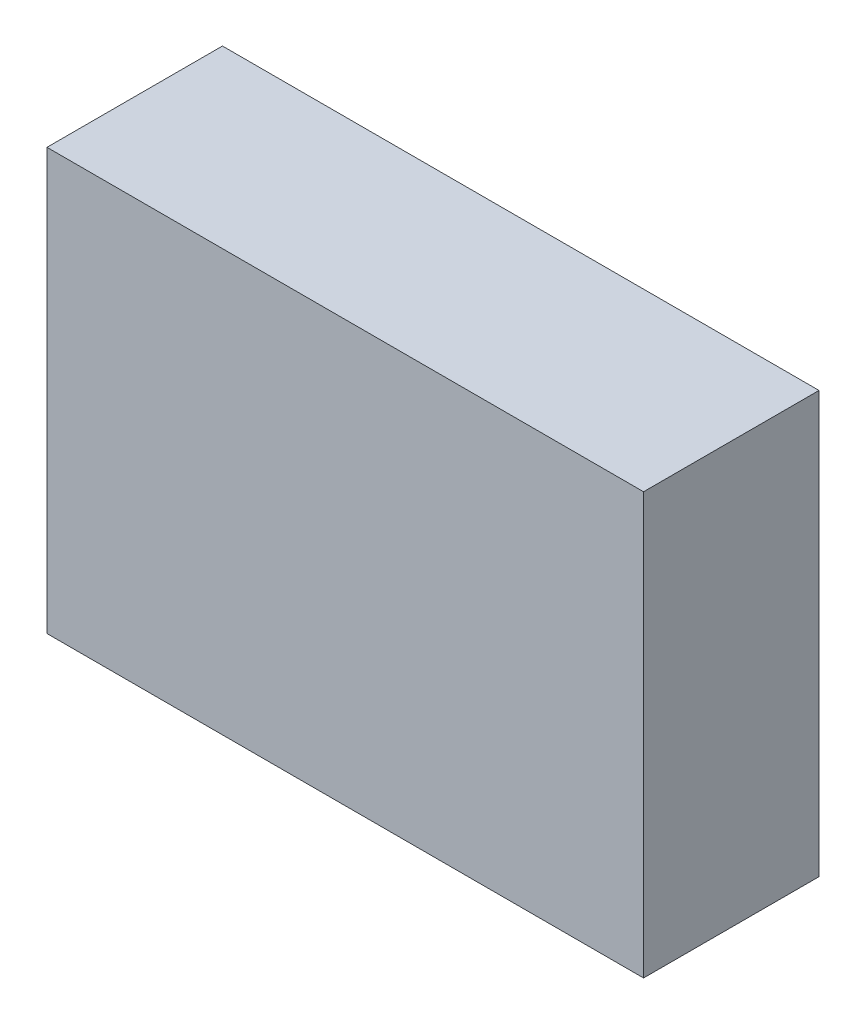
ISO-10303-21;
HEADER;
FILE_DESCRIPTION(('STEP AP214'),'2;1');
FILE_NAME('part.step','',(''),(''),'','','');
FILE_SCHEMA(('AUTOMOTIVE_DESIGN { 1 0 10303 214 1 1 1 1 }'));
ENDSEC;
DATA;
#1=APPLICATION_CONTEXT('core data for automotive mechanical design processes');
#2=APPLICATION_PROTOCOL_DEFINITION('international standard','automotive_design',2000,#1);
#3=PRODUCT_CONTEXT('',#1,'mechanical');
#4=PRODUCT('Part','Part','',(#3));
#5=PRODUCT_RELATED_PRODUCT_CATEGORY('part','',(#4));
#6=PRODUCT_DEFINITION_FORMATION('','',#4);
#7=PRODUCT_DEFINITION_CONTEXT('part definition',#1,'design');
#8=PRODUCT_DEFINITION('design','',#6,#7);
#9=PRODUCT_DEFINITION_SHAPE('','',#8);
#10=(LENGTH_UNIT() NAMED_UNIT(*) SI_UNIT(.MILLI.,.METRE.));
#11=(NAMED_UNIT(*) PLANE_ANGLE_UNIT() SI_UNIT($,.RADIAN.));
#12=(NAMED_UNIT(*) SI_UNIT($,.STERADIAN.) SOLID_ANGLE_UNIT());
#13=UNCERTAINTY_MEASURE_WITH_UNIT(LENGTH_MEASURE(1.E-05),#10,'distance_accuracy_value','');
#14=(GEOMETRIC_REPRESENTATION_CONTEXT(3) GLOBAL_UNCERTAINTY_ASSIGNED_CONTEXT((#13)) GLOBAL_UNIT_ASSIGNED_CONTEXT((#10,
#11,#12)) REPRESENTATION_CONTEXT('',''));
#15=CARTESIAN_POINT('',(0.,0.,0.));
#16=DIRECTION('',(0.,0.,1.));
#17=DIRECTION('',(1.,0.,0.));
#18=AXIS2_PLACEMENT_3D('',#15,#16,#17);
#19=CARTESIAN_POINT('',(-2.92,2.13,0.));
#20=DIRECTION('',(1.,0.,0.));
#21=DIRECTION('',(0.,0.,1.));
#22=AXIS2_PLACEMENT_3D('',#19,#20,#21);
#23=PLANE('',#22);
#24=DIRECTION('',(0.,1.,0.));
#25=VECTOR('',#24,1.);
#26=CARTESIAN_POINT('',(-2.92,2.13,0.1));
#27=LINE('',#26,#25);
#28=CARTESIAN_POINT('',(-2.92,2.13,0.1));
#29=VERTEX_POINT('',#28);
#30=CARTESIAN_POINT('',(-2.92,2.37,0.1));
#31=VERTEX_POINT('',#30);
#32=EDGE_CURVE('E11',#29,#31,#27,.T.);
#33=ORIENTED_EDGE('',*,*,#32,.T.);
#34=DIRECTION('',(0.,0.,1.));
#35=VECTOR('',#34,1.);
#36=CARTESIAN_POINT('',(-2.92,2.37,0.));
#37=LINE('',#36,#35);
#38=CARTESIAN_POINT('',(-2.92,2.37,0.));
#39=VERTEX_POINT('',#38);
#40=EDGE_CURVE('E24',#39,#31,#37,.T.);
#41=ORIENTED_EDGE('',*,*,#40,.F.);
#42=DIRECTION('',(0.,1.,0.));
#43=VECTOR('',#42,1.);
#44=CARTESIAN_POINT('',(-2.92,2.13,0.));
#45=LINE('',#44,#43);
#46=CARTESIAN_POINT('',(-2.92,2.13,0.));
#47=VERTEX_POINT('',#46);
#48=EDGE_CURVE('E86',#47,#39,#45,.T.);
#49=ORIENTED_EDGE('',*,*,#48,.F.);
#50=DIRECTION('',(0.,0.,1.));
#51=VECTOR('',#50,1.);
#52=CARTESIAN_POINT('',(-2.92,2.13,0.));
#53=LINE('',#52,#51);
#54=EDGE_CURVE('E36',#47,#29,#53,.T.);
#55=ORIENTED_EDGE('',*,*,#54,.T.);
#56=EDGE_LOOP('',(#33,#41,#49,#55));
#57=FACE_BOUND('',#56,.T.);
#58=ADVANCED_FACE('F17',(#57),#23,.F.);
#59=CARTESIAN_POINT('',(-2.58,2.13,0.));
#60=DIRECTION('',(1.,0.,0.));
#61=DIRECTION('',(0.,0.,1.));
#62=AXIS2_PLACEMENT_3D('',#59,#60,#61);
#63=PLANE('',#62);
#64=DIRECTION('',(0.,0.,1.));
#65=VECTOR('',#64,1.);
#66=CARTESIAN_POINT('',(-2.58,2.13,0.));
#67=LINE('',#66,#65);
#68=CARTESIAN_POINT('',(-2.58,2.13,0.));
#69=VERTEX_POINT('',#68);
#70=CARTESIAN_POINT('',(-2.58,2.13,0.1));
#71=VERTEX_POINT('',#70);
#72=EDGE_CURVE('E83',#69,#71,#67,.T.);
#73=ORIENTED_EDGE('',*,*,#72,.F.);
#74=DIRECTION('',(0.,1.,0.));
#75=VECTOR('',#74,1.);
#76=CARTESIAN_POINT('',(-2.58,2.13,0.));
#77=LINE('',#76,#75);
#78=CARTESIAN_POINT('',(-2.58,2.37,0.));
#79=VERTEX_POINT('',#78);
#80=EDGE_CURVE('E63',#69,#79,#77,.T.);
#81=ORIENTED_EDGE('',*,*,#80,.T.);
#82=DIRECTION('',(0.,0.,1.));
#83=VECTOR('',#82,1.);
#84=CARTESIAN_POINT('',(-2.58,2.37,0.));
#85=LINE('',#84,#83);
#86=CARTESIAN_POINT('',(-2.58,2.37,0.1));
#87=VERTEX_POINT('',#86);
#88=EDGE_CURVE('E57',#79,#87,#85,.T.);
#89=ORIENTED_EDGE('',*,*,#88,.T.);
#90=DIRECTION('',(0.,1.,0.));
#91=VECTOR('',#90,1.);
#92=CARTESIAN_POINT('',(-2.58,2.13,0.1));
#93=LINE('',#92,#91);
#94=EDGE_CURVE('E60',#71,#87,#93,.T.);
#95=ORIENTED_EDGE('',*,*,#94,.F.);
#96=EDGE_LOOP('',(#73,#81,#89,#95));
#97=FACE_BOUND('',#96,.T.);
#98=ADVANCED_FACE('F59',(#97),#63,.T.);
#99=CARTESIAN_POINT('',(-2.92,2.13,0.));
#100=DIRECTION('',(0.,1.,0.));
#101=DIRECTION('',(0.,0.,1.));
#102=AXIS2_PLACEMENT_3D('',#99,#100,#101);
#103=PLANE('',#102);
#104=ORIENTED_EDGE('',*,*,#72,.T.);
#105=DIRECTION('',(1.,0.,0.));
#106=VECTOR('',#105,1.);
#107=CARTESIAN_POINT('',(-2.92,2.13,0.1));
#108=LINE('',#107,#106);
#109=EDGE_CURVE('E71',#29,#71,#108,.T.);
#110=ORIENTED_EDGE('',*,*,#109,.F.);
#111=ORIENTED_EDGE('',*,*,#54,.F.);
#112=DIRECTION('',(1.,0.,0.));
#113=VECTOR('',#112,1.);
#114=CARTESIAN_POINT('',(-2.92,2.13,0.));
#115=LINE('',#114,#113);
#116=EDGE_CURVE('E76',#47,#69,#115,.T.);
#117=ORIENTED_EDGE('',*,*,#116,.T.);
#118=EDGE_LOOP('',(#104,#110,#111,#117));
#119=FACE_BOUND('',#118,.T.);
#120=ADVANCED_FACE('F91',(#119),#103,.F.);
#121=CARTESIAN_POINT('',(-2.92,2.37,0.));
#122=DIRECTION('',(0.,1.,0.));
#123=DIRECTION('',(0.,0.,1.));
#124=AXIS2_PLACEMENT_3D('',#121,#122,#123);
#125=PLANE('',#124);
#126=DIRECTION('',(1.,0.,0.));
#127=VECTOR('',#126,1.);
#128=CARTESIAN_POINT('',(-2.92,2.37,0.));
#129=LINE('',#128,#127);
#130=EDGE_CURVE('E74',#39,#79,#129,.T.);
#131=ORIENTED_EDGE('',*,*,#130,.F.);
#132=ORIENTED_EDGE('',*,*,#40,.T.);
#133=DIRECTION('',(1.,0.,0.));
#134=VECTOR('',#133,1.);
#135=CARTESIAN_POINT('',(-2.92,2.37,0.1));
#136=LINE('',#135,#134);
#137=EDGE_CURVE('E69',#31,#87,#136,.T.);
#138=ORIENTED_EDGE('',*,*,#137,.T.);
#139=ORIENTED_EDGE('',*,*,#88,.F.);
#140=EDGE_LOOP('',(#131,#132,#138,#139));
#141=FACE_BOUND('',#140,.T.);
#142=ADVANCED_FACE('F73',(#141),#125,.T.);
#143=CARTESIAN_POINT('',(-2.92,2.13,0.));
#144=DIRECTION('',(0.,0.,1.));
#145=DIRECTION('',(1.,0.,0.));
#146=AXIS2_PLACEMENT_3D('',#143,#144,#145);
#147=PLANE('',#146);
#148=ORIENTED_EDGE('',*,*,#130,.T.);
#149=ORIENTED_EDGE('',*,*,#80,.F.);
#150=ORIENTED_EDGE('',*,*,#116,.F.);
#151=ORIENTED_EDGE('',*,*,#48,.T.);
#152=EDGE_LOOP('',(#148,#149,#150,#151));
#153=FACE_BOUND('',#152,.T.);
#154=ADVANCED_FACE('F89',(#153),#147,.F.);
#155=CARTESIAN_POINT('',(-2.92,2.13,0.1));
#156=DIRECTION('',(0.,0.,1.));
#157=DIRECTION('',(1.,0.,0.));
#158=AXIS2_PLACEMENT_3D('',#155,#156,#157);
#159=PLANE('',#158);
#160=ORIENTED_EDGE('',*,*,#32,.F.);
#161=ORIENTED_EDGE('',*,*,#109,.T.);
#162=ORIENTED_EDGE('',*,*,#94,.T.);
#163=ORIENTED_EDGE('',*,*,#137,.F.);
#164=EDGE_LOOP('',(#160,#161,#162,#163));
#165=FACE_BOUND('',#164,.T.);
#166=ADVANCED_FACE('F68',(#165),#159,.T.);
#167=CLOSED_SHELL('',(#58,#98,#120,#142,#154,#166));
#168=MANIFOLD_SOLID_BREP('B1',#167);
#169=ADVANCED_BREP_SHAPE_REPRESENTATION('',(#18,#168),#14);
#170=SHAPE_DEFINITION_REPRESENTATION(#9,#169);
ENDSEC;
END-ISO-10303-21;
